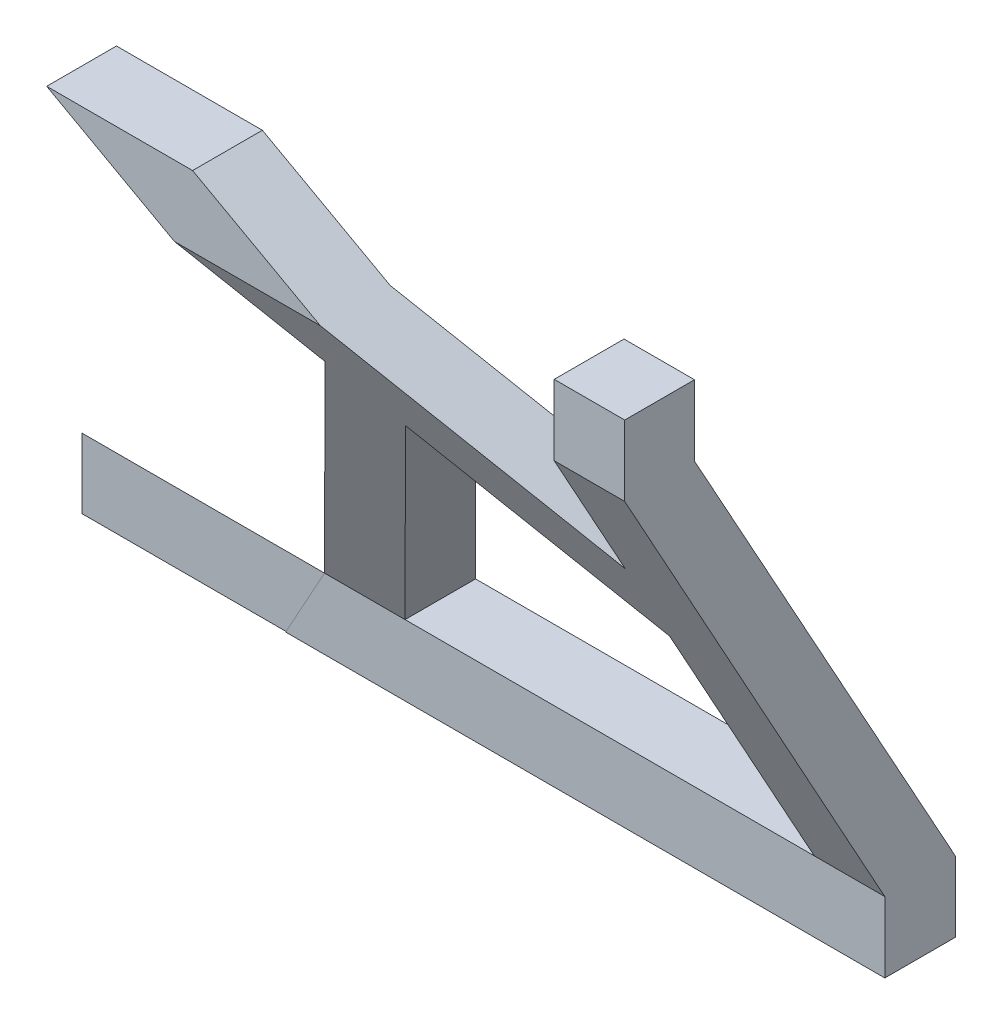
ISO-10303-21;
HEADER;
FILE_DESCRIPTION(('STEP AP214'),'2;1');
FILE_NAME('part.step','',(''),(''),'','','');
FILE_SCHEMA(('AUTOMOTIVE_DESIGN { 1 0 10303 214 1 1 1 1 }'));
ENDSEC;
DATA;
#1=APPLICATION_CONTEXT('core data for automotive mechanical design processes');
#2=APPLICATION_PROTOCOL_DEFINITION('international standard','automotive_design',2000,#1);
#3=PRODUCT_CONTEXT('',#1,'mechanical');
#4=PRODUCT('Part','Part','',(#3));
#5=PRODUCT_RELATED_PRODUCT_CATEGORY('part','',(#4));
#6=PRODUCT_DEFINITION_FORMATION('','',#4);
#7=PRODUCT_DEFINITION_CONTEXT('part definition',#1,'design');
#8=PRODUCT_DEFINITION('design','',#6,#7);
#9=PRODUCT_DEFINITION_SHAPE('','',#8);
#10=(LENGTH_UNIT() NAMED_UNIT(*) SI_UNIT(.MILLI.,.METRE.));
#11=(NAMED_UNIT(*) PLANE_ANGLE_UNIT() SI_UNIT($,.RADIAN.));
#12=(NAMED_UNIT(*) SI_UNIT($,.STERADIAN.) SOLID_ANGLE_UNIT());
#13=UNCERTAINTY_MEASURE_WITH_UNIT(LENGTH_MEASURE(1.E-05),#10,'distance_accuracy_value','');
#14=(GEOMETRIC_REPRESENTATION_CONTEXT(3) GLOBAL_UNCERTAINTY_ASSIGNED_CONTEXT((#13)) GLOBAL_UNIT_ASSIGNED_CONTEXT((#10,
#11,#12)) REPRESENTATION_CONTEXT('',''));
#15=CARTESIAN_POINT('',(0.,0.,0.));
#16=DIRECTION('',(0.,0.,1.));
#17=DIRECTION('',(1.,0.,0.));
#18=AXIS2_PLACEMENT_3D('',#15,#16,#17);
#19=CARTESIAN_POINT('',(0.,29.5620174648456,-53.6762918738388));
#20=DIRECTION('',(0.,-0.482420541255381,0.875939736154757));
#21=DIRECTION('',(0.,0.875939736154757,0.482420541255381));
#22=AXIS2_PLACEMENT_3D('',#19,#20,#21);
#23=PLANE('',#22);
#24=DIRECTION('',(0.435173799181996,0.788649248632509,0.434345630963277));
#25=VECTOR('',#24,1.);
#26=CARTESIAN_POINT('',(61.1524327788924,3.67148150275816,-67.935407948481));
#27=LINE('',#26,#25);
#28=CARTESIAN_POINT('',(64.6444863659764,10.,-64.45));
#29=VERTEX_POINT('',#28);
#30=CARTESIAN_POINT('',(93.9619940574629,63.1310259398199,-35.188285713741));
#31=VERTEX_POINT('',#30);
#32=EDGE_CURVE('E457',#29,#31,#27,.T.);
#33=ORIENTED_EDGE('',*,*,#32,.T.);
#34=DIRECTION('',(0.846111406818246,-0.466881209960924,-0.257133084291912));
#35=VECTOR('',#34,1.);
#36=CARTESIAN_POINT('',(43.9773724193006,90.7123591328342,-19.9979693731107));
#37=LINE('',#36,#35);
#38=CARTESIAN_POINT('',(122.705142441915,47.2706607589708,-43.9233226566265));
#39=VERTEX_POINT('',#38);
#40=EDGE_CURVE('E445',#31,#39,#37,.T.);
#41=ORIENTED_EDGE('',*,*,#40,.T.);
#42=DIRECTION('',(0.,-0.875939736154757,-0.482420541255381));
#43=VECTOR('',#42,1.);
#44=CARTESIAN_POINT('',(122.705142441915,29.562017464846,-53.6762918738386));
#45=LINE('',#44,#43);
#46=CARTESIAN_POINT('',(122.705142441915,10.,-64.45));
#47=VERTEX_POINT('',#46);
#48=EDGE_CURVE('E449',#39,#47,#45,.T.);
#49=ORIENTED_EDGE('',*,*,#48,.T.);
#50=DIRECTION('',(1.,0.,0.));
#51=VECTOR('',#50,1.);
#52=CARTESIAN_POINT('',(0.,10.,-64.45));
#53=LINE('',#52,#51);
#54=CARTESIAN_POINT('',(132.705142441915,10.,-64.45));
#55=VERTEX_POINT('',#54);
#56=EDGE_CURVE('E820',#55,#47,#53,.F.);
#57=ORIENTED_EDGE('',*,*,#56,.F.);
#58=DIRECTION('',(0.,-0.875939736154757,-0.482420541255381));
#59=VECTOR('',#58,1.);
#60=CARTESIAN_POINT('',(132.705142441915,77.,-27.55));
#61=LINE('',#60,#59);
#62=CARTESIAN_POINT('',(132.705142441915,77.,-27.55));
#63=VERTEX_POINT('',#62);
#64=EDGE_CURVE('E489',#63,#55,#61,.T.);
#65=ORIENTED_EDGE('',*,*,#64,.F.);
#66=DIRECTION('',(-1.,0.,0.));
#67=VECTOR('',#66,1.);
#68=CARTESIAN_POINT('',(50.7051424419148,77.,-27.55));
#69=LINE('',#68,#67);
#70=CARTESIAN_POINT('',(122.705142441915,77.,-27.55));
#71=VERTEX_POINT('',#70);
#72=EDGE_CURVE('E484',#63,#71,#69,.T.);
#73=ORIENTED_EDGE('',*,*,#72,.T.);
#74=DIRECTION('',(0.,0.875939736154757,0.482420541255381));
#75=VECTOR('',#74,1.);
#76=CARTESIAN_POINT('',(122.705142441915,29.5620174648453,-53.6762918738389));
#77=LINE('',#76,#75);
#78=CARTESIAN_POINT('',(122.705142441915,58.6920408995561,-37.6330401612893));
#79=VERTEX_POINT('',#78);
#80=EDGE_CURVE('E370',#79,#71,#77,.T.);
#81=ORIENTED_EDGE('',*,*,#80,.F.);
#82=DIRECTION('',(0.846111406818246,-0.466881209960924,-0.257133084291912));
#83=VECTOR('',#82,1.);
#84=CARTESIAN_POINT('',(49.8577346026244,98.8889767172891,-15.4947277482393));
#85=LINE('',#84,#83);
#86=CARTESIAN_POINT('',(89.5263108677249,77.,-27.55));
#87=VERTEX_POINT('',#86);
#88=EDGE_CURVE('E392',#87,#79,#85,.T.);
#89=ORIENTED_EDGE('',*,*,#88,.F.);
#90=CARTESIAN_POINT('',(68.8277695420515,77.,-27.55));
#91=VERTEX_POINT('',#90);
#92=EDGE_CURVE('E787',#87,#91,#69,.T.);
#93=ORIENTED_EDGE('',*,*,#92,.T.);
#94=DIRECTION('',(0.846111406818246,-0.466881209960925,-0.257133084291912));
#95=VECTOR('',#94,1.);
#96=CARTESIAN_POINT('',(43.9773724193007,90.7123591328342,-19.9979693731107));
#97=LINE('',#96,#95);
#98=CARTESIAN_POINT('',(85.2064847609414,67.9622842602294,-32.5274882208588));
#99=VERTEX_POINT('',#98);
#100=EDGE_CURVE('E415',#91,#99,#97,.T.);
#101=ORIENTED_EDGE('',*,*,#100,.T.);
#102=DIRECTION('',(-0.435173799181996,-0.788649248632509,-0.434345630963277));
#103=VECTOR('',#102,1.);
#104=CARTESIAN_POINT('',(51.8939906134827,7.59129333924137,-65.7765862057014));
#105=LINE('',#104,#103);
#106=CARTESIAN_POINT('',(53.2231062253911,10.,-64.45));
#107=VERTEX_POINT('',#106);
#108=EDGE_CURVE('E438',#99,#107,#105,.T.);
#109=ORIENTED_EDGE('',*,*,#108,.T.);
#110=EDGE_CURVE('E827',#29,#107,#53,.F.);
#111=ORIENTED_EDGE('',*,*,#110,.F.);
#112=EDGE_LOOP('',(#33,#41,#49,#57,#65,#73,#81,#89,#93,#101,#109,#111));
#113=FACE_BOUND('',#112,.T.);
#114=ADVANCED_FACE('F179',(#113),#23,.T.);
#115=CARTESIAN_POINT('',(0.,33.842872994196,-61.2830402867873));
#116=DIRECTION('',(0.,0.483422700834169,-0.875387052861874));
#117=DIRECTION('',(0.,-0.875387052861874,-0.483422700834169));
#118=AXIS2_PLACEMENT_3D('',#115,#116,#117);
#119=PLANE('',#118);
#120=DIRECTION('',(-0.434951180292689,-0.788245804720872,-0.435299922010034));
#121=VECTOR('',#120,1.);
#122=CARTESIAN_POINT('',(63.082326799024,7.16895646972114,-76.0134120988107));
#123=LINE('',#122,#121);
#124=CARTESIAN_POINT('',(93.9619940574629,63.1310259398199,-45.1089856750248));
#125=VERTEX_POINT('',#124);
#126=CARTESIAN_POINT('',(64.6444863659764,10.,-74.45));
#127=VERTEX_POINT('',#126);
#128=EDGE_CURVE('E847',#125,#127,#123,.T.);
#129=ORIENTED_EDGE('',*,*,#128,.T.);
#130=DIRECTION('',(1.,0.,0.));
#131=VECTOR('',#130,1.);
#132=CARTESIAN_POINT('',(0.,9.99999999999998,-74.45));
#133=LINE('',#132,#131);
#134=CARTESIAN_POINT('',(53.2231062253911,9.99999999999998,-74.45));
#135=VERTEX_POINT('',#134);
#136=EDGE_CURVE('E832',#135,#127,#133,.T.);
#137=ORIENTED_EDGE('',*,*,#136,.F.);
#138=DIRECTION('',(0.434951180292689,0.788245804720872,0.435299922010034));
#139=VECTOR('',#138,1.);
#140=CARTESIAN_POINT('',(53.8216722408234,11.0847588692494,-73.8509540572802));
#141=LINE('',#140,#139);
#142=CARTESIAN_POINT('',(85.2064847609414,67.9622842602294,-42.4409773488285));
#143=VERTEX_POINT('',#142);
#144=EDGE_CURVE('E812',#135,#143,#141,.T.);
#145=ORIENTED_EDGE('',*,*,#144,.T.);
#146=DIRECTION('',(-0.845959635986386,0.466797463365566,0.257783673798894));
#147=VECTOR('',#146,1.);
#148=CARTESIAN_POINT('',(41.811110590326,91.9076945646152,-29.2173925538692));
#149=LINE('',#148,#147);
#150=CARTESIAN_POINT('',(68.8277695420515,77.,-37.45));
#151=VERTEX_POINT('',#150);
#152=EDGE_CURVE('E427',#143,#151,#149,.T.);
#153=ORIENTED_EDGE('',*,*,#152,.T.);
#154=DIRECTION('',(1.,0.,0.));
#155=VECTOR('',#154,1.);
#156=CARTESIAN_POINT('',(50.7051424419148,77.,-37.45));
#157=LINE('',#156,#155);
#158=CARTESIAN_POINT('',(89.5263108677249,77.,-37.45));
#159=VERTEX_POINT('',#158);
#160=EDGE_CURVE('E535',#151,#159,#157,.T.);
#161=ORIENTED_EDGE('',*,*,#160,.T.);
#162=DIRECTION('',(-0.845959635986386,0.466797463365565,0.257783673798894));
#163=VECTOR('',#162,1.);
#164=CARTESIAN_POINT('',(47.6967883045674,100.081379058361,-24.7035667886665));
#165=LINE('',#164,#163);
#166=CARTESIAN_POINT('',(122.705142441915,58.6920408995561,-47.5603654733795));
#167=VERTEX_POINT('',#166);
#168=EDGE_CURVE('E404',#167,#159,#165,.T.);
#169=ORIENTED_EDGE('',*,*,#168,.F.);
#170=DIRECTION('',(0.,-0.875387052861874,-0.483422700834169));
#171=VECTOR('',#170,1.);
#172=CARTESIAN_POINT('',(122.705142441915,33.8428729941957,-61.2830402867874));
#173=LINE('',#172,#171);
#174=CARTESIAN_POINT('',(122.705142441915,77.,-37.45));
#175=VERTEX_POINT('',#174);
#176=EDGE_CURVE('E381',#175,#167,#173,.T.);
#177=ORIENTED_EDGE('',*,*,#176,.F.);
#178=CARTESIAN_POINT('',(132.705142441915,77.,-37.45));
#179=VERTEX_POINT('',#178);
#180=EDGE_CURVE('E541',#175,#179,#157,.T.);
#181=ORIENTED_EDGE('',*,*,#180,.T.);
#182=DIRECTION('',(0.,-0.875387052861874,-0.483422700834169));
#183=VECTOR('',#182,1.);
#184=CARTESIAN_POINT('',(132.705142441915,77.,-37.45));
#185=LINE('',#184,#183);
#186=CARTESIAN_POINT('',(132.705142441915,10.,-74.45));
#187=VERTEX_POINT('',#186);
#188=EDGE_CURVE('E868',#179,#187,#185,.T.);
#189=ORIENTED_EDGE('',*,*,#188,.T.);
#190=CARTESIAN_POINT('',(122.705142441915,9.99999999999999,-74.45));
#191=VERTEX_POINT('',#190);
#192=EDGE_CURVE('E828',#191,#187,#133,.T.);
#193=ORIENTED_EDGE('',*,*,#192,.F.);
#194=DIRECTION('',(0.,0.875387052861874,0.483422700834169));
#195=VECTOR('',#194,1.);
#196=CARTESIAN_POINT('',(122.705142441915,33.8428729941964,-61.283040286787));
#197=LINE('',#196,#195);
#198=CARTESIAN_POINT('',(122.705142441915,47.2706607589708,-53.8676948047474));
#199=VERTEX_POINT('',#198);
#200=EDGE_CURVE('E850',#191,#199,#197,.T.);
#201=ORIENTED_EDGE('',*,*,#200,.T.);
#202=DIRECTION('',(-0.845959635986386,0.466797463365565,0.257783673798894));
#203=VECTOR('',#202,1.);
#204=CARTESIAN_POINT('',(41.8111105903259,91.9076945646152,-29.2173925538692));
#205=LINE('',#204,#203);
#206=EDGE_CURVE('E856',#199,#125,#205,.T.);
#207=ORIENTED_EDGE('',*,*,#206,.T.);
#208=EDGE_LOOP('',(#129,#137,#145,#153,#161,#169,#177,#181,#189,#193,#201,#207));
#209=FACE_BOUND('',#208,.T.);
#210=ADVANCED_FACE('F501',(#209),#119,.T.);
#211=CARTESIAN_POINT('',(50.7051424419148,77.,-37.45));
#212=DIRECTION('',(0.,0.,-1.));
#213=DIRECTION('',(1.,0.,0.));
#214=AXIS2_PLACEMENT_3D('',#211,#212,#213);
#215=PLANE('',#214);
#216=DIRECTION('',(-0.875550929652146,0.483125832040953,0.));
#217=VECTOR('',#216,1.);
#218=CARTESIAN_POINT('',(54.9351551557391,84.6658943041474,-37.45));
#219=LINE('',#218,#217);
#220=CARTESIAN_POINT('',(50.7051424419148,87.,-37.45));
#221=VERTEX_POINT('',#220);
#222=EDGE_CURVE('E421',#151,#221,#219,.T.);
#223=ORIENTED_EDGE('',*,*,#222,.T.);
#224=DIRECTION('',(1.,0.,0.));
#225=VECTOR('',#224,1.);
#226=CARTESIAN_POINT('',(50.7051424419148,87.,-37.45));
#227=LINE('',#226,#225);
#228=CARTESIAN_POINT('',(71.4036837675881,87.,-37.45));
#229=VERTEX_POINT('',#228);
#230=EDGE_CURVE('E473',#221,#229,#227,.T.);
#231=ORIENTED_EDGE('',*,*,#230,.T.);
#232=DIRECTION('',(-0.875550929652146,0.483125832040952,0.));
#233=VECTOR('',#232,1.);
#234=CARTESIAN_POINT('',(59.7664134761486,93.4214036006688,-37.45));
#235=LINE('',#234,#233);
#236=EDGE_CURVE('E398',#159,#229,#235,.T.);
#237=ORIENTED_EDGE('',*,*,#236,.F.);
#238=ORIENTED_EDGE('',*,*,#160,.F.);
#239=EDGE_LOOP('',(#223,#231,#237,#238));
#240=FACE_BOUND('',#239,.T.);
#241=ADVANCED_FACE('F508',(#240),#215,.T.);
#242=CARTESIAN_POINT('',(122.705142441915,87.,-37.45));
#243=VERTEX_POINT('',#242);
#244=CARTESIAN_POINT('',(132.705142441915,87.,-37.45));
#245=VERTEX_POINT('',#244);
#246=EDGE_CURVE('E472',#243,#245,#227,.T.);
#247=ORIENTED_EDGE('',*,*,#246,.T.);
#248=DIRECTION('',(0.,1.,0.));
#249=VECTOR('',#248,1.);
#250=CARTESIAN_POINT('',(132.705142441915,77.,-37.45));
#251=LINE('',#250,#249);
#252=EDGE_CURVE('E771',#179,#245,#251,.T.);
#253=ORIENTED_EDGE('',*,*,#252,.F.);
#254=ORIENTED_EDGE('',*,*,#180,.F.);
#255=DIRECTION('',(0.,-1.,0.));
#256=VECTOR('',#255,1.);
#257=CARTESIAN_POINT('',(122.705142441915,76.9999999999998,-37.45));
#258=LINE('',#257,#256);
#259=EDGE_CURVE('E376',#243,#175,#258,.T.);
#260=ORIENTED_EDGE('',*,*,#259,.F.);
#261=EDGE_LOOP('',(#247,#253,#254,#260));
#262=FACE_BOUND('',#261,.T.);
#263=ADVANCED_FACE('F559',(#262),#215,.T.);
#264=CARTESIAN_POINT('',(50.7051424419148,77.,-27.55));
#265=DIRECTION('',(0.,0.,1.));
#266=DIRECTION('',(-1.,0.,0.));
#267=AXIS2_PLACEMENT_3D('',#264,#265,#266);
#268=PLANE('',#267);
#269=DIRECTION('',(0.875550929652146,-0.483125832040953,0.));
#270=VECTOR('',#269,1.);
#271=CARTESIAN_POINT('',(54.9351551557391,84.6658943041474,-27.55));
#272=LINE('',#271,#270);
#273=CARTESIAN_POINT('',(50.7051424419148,87.,-27.55));
#274=VERTEX_POINT('',#273);
#275=EDGE_CURVE('E410',#274,#91,#272,.T.);
#276=ORIENTED_EDGE('',*,*,#275,.T.);
#277=ORIENTED_EDGE('',*,*,#92,.F.);
#278=DIRECTION('',(0.875550929652146,-0.483125832040952,0.));
#279=VECTOR('',#278,1.);
#280=CARTESIAN_POINT('',(59.7664134761486,93.4214036006688,-27.55));
#281=LINE('',#280,#279);
#282=CARTESIAN_POINT('',(71.4036837675881,87.,-27.55));
#283=VERTEX_POINT('',#282);
#284=EDGE_CURVE('E387',#283,#87,#281,.T.);
#285=ORIENTED_EDGE('',*,*,#284,.F.);
#286=DIRECTION('',(-1.,0.,0.));
#287=VECTOR('',#286,1.);
#288=CARTESIAN_POINT('',(50.7051424419148,87.,-27.55));
#289=LINE('',#288,#287);
#290=EDGE_CURVE('E464',#283,#274,#289,.T.);
#291=ORIENTED_EDGE('',*,*,#290,.T.);
#292=EDGE_LOOP('',(#276,#277,#285,#291));
#293=FACE_BOUND('',#292,.T.);
#294=ADVANCED_FACE('F502',(#293),#268,.T.);
#295=ORIENTED_EDGE('',*,*,#72,.F.);
#296=DIRECTION('',(0.,1.,0.));
#297=VECTOR('',#296,1.);
#298=CARTESIAN_POINT('',(132.705142441915,77.,-27.55));
#299=LINE('',#298,#297);
#300=CARTESIAN_POINT('',(132.705142441915,87.,-27.55));
#301=VERTEX_POINT('',#300);
#302=EDGE_CURVE('E477',#63,#301,#299,.T.);
#303=ORIENTED_EDGE('',*,*,#302,.T.);
#304=CARTESIAN_POINT('',(122.705142441915,87.,-27.55));
#305=VERTEX_POINT('',#304);
#306=EDGE_CURVE('E465',#301,#305,#289,.T.);
#307=ORIENTED_EDGE('',*,*,#306,.T.);
#308=DIRECTION('',(0.,1.,0.));
#309=VECTOR('',#308,1.);
#310=CARTESIAN_POINT('',(122.705142441915,76.9999999999998,-27.55));
#311=LINE('',#310,#309);
#312=EDGE_CURVE('E366',#71,#305,#311,.T.);
#313=ORIENTED_EDGE('',*,*,#312,.F.);
#314=EDGE_LOOP('',(#295,#303,#307,#313));
#315=FACE_BOUND('',#314,.T.);
#316=ADVANCED_FACE('F565',(#315),#268,.T.);
#317=CARTESIAN_POINT('',(0.,87.,0.));
#318=DIRECTION('',(0.,-1.,0.));
#319=DIRECTION('',(0.,0.,1.));
#320=AXIS2_PLACEMENT_3D('',#317,#318,#319);
#321=PLANE('',#320);
#322=DIRECTION('',(0.,0.,-1.));
#323=VECTOR('',#322,1.);
#324=CARTESIAN_POINT('',(71.4036837675881,87.,0.));
#325=LINE('',#324,#323);
#326=EDGE_CURVE('E792',#283,#229,#325,.T.);
#327=ORIENTED_EDGE('',*,*,#326,.T.);
#328=ORIENTED_EDGE('',*,*,#230,.F.);
#329=DIRECTION('',(0.,0.,-1.));
#330=VECTOR('',#329,1.);
#331=CARTESIAN_POINT('',(50.7051424419148,87.,-37.45));
#332=LINE('',#331,#330);
#333=EDGE_CURVE('E469',#274,#221,#332,.T.);
#334=ORIENTED_EDGE('',*,*,#333,.F.);
#335=ORIENTED_EDGE('',*,*,#290,.F.);
#336=EDGE_LOOP('',(#327,#328,#334,#335));
#337=FACE_BOUND('',#336,.T.);
#338=ADVANCED_FACE('F561',(#337),#321,.F.);
#339=DIRECTION('',(0.,0.,1.));
#340=VECTOR('',#339,1.);
#341=CARTESIAN_POINT('',(122.705142441915,87.,0.));
#342=LINE('',#341,#340);
#343=EDGE_CURVE('E806',#243,#305,#342,.T.);
#344=ORIENTED_EDGE('',*,*,#343,.T.);
#345=ORIENTED_EDGE('',*,*,#306,.F.);
#346=DIRECTION('',(0.,0.,1.));
#347=VECTOR('',#346,1.);
#348=CARTESIAN_POINT('',(132.705142441915,87.,-37.45));
#349=LINE('',#348,#347);
#350=EDGE_CURVE('E461',#245,#301,#349,.T.);
#351=ORIENTED_EDGE('',*,*,#350,.F.);
#352=ORIENTED_EDGE('',*,*,#246,.F.);
#353=EDGE_LOOP('',(#344,#345,#351,#352));
#354=FACE_BOUND('',#353,.T.);
#355=ADVANCED_FACE('F564',(#354),#321,.F.);
#356=CARTESIAN_POINT('',(47.7051424419148,10.,-74.45));
#357=DIRECTION('',(0.,0.,1.));
#358=DIRECTION('',(-1.,0.,0.));
#359=AXIS2_PLACEMENT_3D('',#356,#357,#358);
#360=PLANE('',#359);
#361=ORIENTED_EDGE('',*,*,#136,.T.);
#362=EDGE_CURVE('E830',#127,#191,#133,.T.);
#363=ORIENTED_EDGE('',*,*,#362,.T.);
#364=ORIENTED_EDGE('',*,*,#192,.T.);
#365=DIRECTION('',(0.,-1.,0.));
#366=VECTOR('',#365,1.);
#367=CARTESIAN_POINT('',(132.705142441915,10.,-74.45));
#368=LINE('',#367,#366);
#369=CARTESIAN_POINT('',(132.705142441915,0.,-74.45));
#370=VERTEX_POINT('',#369);
#371=EDGE_CURVE('E808',#187,#370,#368,.T.);
#372=ORIENTED_EDGE('',*,*,#371,.T.);
#373=DIRECTION('',(1.,0.,0.));
#374=VECTOR('',#373,1.);
#375=CARTESIAN_POINT('',(47.7051424419148,0.,-74.45));
#376=LINE('',#375,#374);
#377=CARTESIAN_POINT('',(47.7051424419148,0.,-74.45));
#378=VERTEX_POINT('',#377);
#379=EDGE_CURVE('E872',#378,#370,#376,.T.);
#380=ORIENTED_EDGE('',*,*,#379,.F.);
#381=DIRECTION('',(-0.483125832040953,-0.875550929652146,0.));
#382=VECTOR('',#381,1.);
#383=CARTESIAN_POINT('',(51.9351551557391,7.66589430414738,-74.45));
#384=LINE('',#383,#382);
#385=EDGE_CURVE('E433',#135,#378,#384,.T.);
#386=ORIENTED_EDGE('',*,*,#385,.F.);
#387=EDGE_LOOP('',(#361,#363,#364,#372,#380,#386));
#388=FACE_BOUND('',#387,.T.);
#389=ADVANCED_FACE('F181',(#388),#360,.F.);
#390=CARTESIAN_POINT('',(132.705142441915,10.,-74.45));
#391=DIRECTION('',(-1.,0.,0.));
#392=DIRECTION('',(0.,0.,-1.));
#393=AXIS2_PLACEMENT_3D('',#390,#391,#392);
#394=PLANE('',#393);
#395=ORIENTED_EDGE('',*,*,#371,.F.);
#396=ORIENTED_EDGE('',*,*,#188,.F.);
#397=ORIENTED_EDGE('',*,*,#252,.T.);
#398=ORIENTED_EDGE('',*,*,#350,.T.);
#399=ORIENTED_EDGE('',*,*,#302,.F.);
#400=ORIENTED_EDGE('',*,*,#64,.T.);
#401=DIRECTION('',(0.,-1.,0.));
#402=VECTOR('',#401,1.);
#403=CARTESIAN_POINT('',(132.705142441915,10.,-64.45));
#404=LINE('',#403,#402);
#405=CARTESIAN_POINT('',(132.705142441915,0.,-64.45));
#406=VERTEX_POINT('',#405);
#407=EDGE_CURVE('E814',#55,#406,#404,.T.);
#408=ORIENTED_EDGE('',*,*,#407,.T.);
#409=DIRECTION('',(0.,0.,1.));
#410=VECTOR('',#409,1.);
#411=CARTESIAN_POINT('',(132.705142441915,0.,-74.45));
#412=LINE('',#411,#410);
#413=EDGE_CURVE('E875',#370,#406,#412,.T.);
#414=ORIENTED_EDGE('',*,*,#413,.F.);
#415=EDGE_LOOP('',(#395,#396,#397,#398,#399,#400,#408,#414));
#416=FACE_BOUND('',#415,.T.);
#417=ADVANCED_FACE('F659',(#416),#394,.F.);
#418=CARTESIAN_POINT('',(47.7051424419148,10.,-64.45));
#419=DIRECTION('',(0.,0.,-1.));
#420=DIRECTION('',(1.,0.,0.));
#421=AXIS2_PLACEMENT_3D('',#418,#419,#420);
#422=PLANE('',#421);
#423=DIRECTION('',(-1.,0.,0.));
#424=VECTOR('',#423,1.);
#425=CARTESIAN_POINT('',(47.7051424419148,0.,-64.45));
#426=LINE('',#425,#424);
#427=CARTESIAN_POINT('',(47.7051424419148,0.,-64.45));
#428=VERTEX_POINT('',#427);
#429=EDGE_CURVE('E831',#406,#428,#426,.T.);
#430=ORIENTED_EDGE('',*,*,#429,.F.);
#431=ORIENTED_EDGE('',*,*,#407,.F.);
#432=ORIENTED_EDGE('',*,*,#56,.T.);
#433=DIRECTION('',(-1.,0.,0.));
#434=VECTOR('',#433,1.);
#435=CARTESIAN_POINT('',(0.,10.,-64.45));
#436=LINE('',#435,#434);
#437=EDGE_CURVE('E453',#47,#29,#436,.T.);
#438=ORIENTED_EDGE('',*,*,#437,.T.);
#439=ORIENTED_EDGE('',*,*,#110,.T.);
#440=DIRECTION('',(0.483125832040953,0.875550929652146,0.));
#441=VECTOR('',#440,1.);
#442=CARTESIAN_POINT('',(51.9351551557391,7.66589430414738,-64.45));
#443=LINE('',#442,#441);
#444=EDGE_CURVE('E442',#428,#107,#443,.T.);
#445=ORIENTED_EDGE('',*,*,#444,.F.);
#446=EDGE_LOOP('',(#430,#431,#432,#438,#439,#445));
#447=FACE_BOUND('',#446,.T.);
#448=ADVANCED_FACE('F653',(#447),#422,.F.);
#449=CARTESIAN_POINT('',(0.,0.,0.));
#450=DIRECTION('',(0.,-1.,0.));
#451=DIRECTION('',(0.,0.,1.));
#452=AXIS2_PLACEMENT_3D('',#449,#450,#451);
#453=PLANE('',#452);
#454=ORIENTED_EDGE('',*,*,#429,.T.);
#455=DIRECTION('',(0.,0.,-1.));
#456=VECTOR('',#455,1.);
#457=CARTESIAN_POINT('',(47.7051424419148,0.,-74.45));
#458=LINE('',#457,#456);
#459=CARTESIAN_POINT('',(47.7051424419148,0.,-64.55));
#460=VERTEX_POINT('',#459);
#461=EDGE_CURVE('E843',#428,#460,#458,.T.);
#462=ORIENTED_EDGE('',*,*,#461,.T.);
#463=DIRECTION('',(1.,0.,0.));
#464=VECTOR('',#463,1.);
#465=CARTESIAN_POINT('',(18.7051424419149,0.,-64.55));
#466=LINE('',#465,#464);
#467=CARTESIAN_POINT('',(18.7051424419149,0.,-64.55));
#468=VERTEX_POINT('',#467);
#469=EDGE_CURVE('E334',#468,#460,#466,.T.);
#470=ORIENTED_EDGE('',*,*,#469,.F.);
#471=DIRECTION('',(0.,0.,1.));
#472=VECTOR('',#471,1.);
#473=CARTESIAN_POINT('',(18.7051424419149,0.,-64.55));
#474=LINE('',#473,#472);
#475=CARTESIAN_POINT('',(18.7051424419149,0.,-74.45));
#476=VERTEX_POINT('',#475);
#477=EDGE_CURVE('E322',#476,#468,#474,.T.);
#478=ORIENTED_EDGE('',*,*,#477,.F.);
#479=DIRECTION('',(1.,0.,0.));
#480=VECTOR('',#479,1.);
#481=CARTESIAN_POINT('',(18.7051424419149,0.,-74.45));
#482=LINE('',#481,#480);
#483=EDGE_CURVE('E328',#476,#378,#482,.T.);
#484=ORIENTED_EDGE('',*,*,#483,.T.);
#485=ORIENTED_EDGE('',*,*,#379,.T.);
#486=ORIENTED_EDGE('',*,*,#413,.T.);
#487=EDGE_LOOP('',(#454,#462,#470,#478,#484,#485,#486));
#488=FACE_BOUND('',#487,.T.);
#489=ADVANCED_FACE('F337',(#488),#453,.T.);
#490=CARTESIAN_POINT('',(53.4674851089494,96.8971294611604,-27.5499));
#491=DIRECTION('',(0.483125832040952,0.875550929652146,0.));
#492=DIRECTION('',(-0.875550929652146,0.483125832040952,0.));
#493=AXIS2_PLACEMENT_3D('',#490,#491,#492);
#494=PLANE('',#493);
#495=DIRECTION('',(0.,0.,1.));
#496=VECTOR('',#495,1.);
#497=CARTESIAN_POINT('',(122.705142441915,58.6920408995561,-27.5499));
#498=LINE('',#497,#496);
#499=EDGE_CURVE('E363',#167,#79,#498,.T.);
#500=ORIENTED_EDGE('',*,*,#499,.F.);
#501=ORIENTED_EDGE('',*,*,#168,.T.);
#502=ORIENTED_EDGE('',*,*,#236,.T.);
#503=ORIENTED_EDGE('',*,*,#326,.F.);
#504=ORIENTED_EDGE('',*,*,#284,.T.);
#505=ORIENTED_EDGE('',*,*,#88,.T.);
#506=EDGE_LOOP('',(#500,#501,#502,#503,#504,#505));
#507=FACE_BOUND('',#506,.T.);
#508=ADVANCED_FACE('F567',(#507),#494,.T.);
#509=CARTESIAN_POINT('',(122.705142441915,-3.00776881105116E-13,-27.5499));
#510=DIRECTION('',(-1.,0.,0.));
#511=DIRECTION('',(0.,-1.,0.));
#512=AXIS2_PLACEMENT_3D('',#509,#510,#511);
#513=PLANE('',#512);
#514=ORIENTED_EDGE('',*,*,#259,.T.);
#515=ORIENTED_EDGE('',*,*,#176,.T.);
#516=ORIENTED_EDGE('',*,*,#499,.T.);
#517=ORIENTED_EDGE('',*,*,#80,.T.);
#518=ORIENTED_EDGE('',*,*,#312,.T.);
#519=ORIENTED_EDGE('',*,*,#343,.F.);
#520=EDGE_LOOP('',(#514,#515,#516,#517,#518,#519));
#521=FACE_BOUND('',#520,.T.);
#522=ADVANCED_FACE('F570',(#521),#513,.T.);
#523=CARTESIAN_POINT('',(85.2064847609414,67.9622842602294,-27.5499));
#524=DIRECTION('',(0.875550929652146,-0.483125832040953,0.));
#525=DIRECTION('',(0.483125832040953,0.875550929652146,0.));
#526=AXIS2_PLACEMENT_3D('',#523,#524,#525);
#527=PLANE('',#526);
#528=DIRECTION('',(0.483125832040953,0.875550929652146,0.));
#529=VECTOR('',#528,1.);
#530=CARTESIAN_POINT('',(85.2064847609414,67.9622842602294,-64.55));
#531=LINE('',#530,#529);
#532=CARTESIAN_POINT('',(53.1679265875563,9.9,-64.55));
#533=VERTEX_POINT('',#532);
#534=EDGE_CURVE('E188',#460,#533,#531,.T.);
#535=ORIENTED_EDGE('',*,*,#534,.F.);
#536=ORIENTED_EDGE('',*,*,#461,.F.);
#537=ORIENTED_EDGE('',*,*,#444,.T.);
#538=ORIENTED_EDGE('',*,*,#108,.F.);
#539=DIRECTION('',(0.,0.,1.));
#540=VECTOR('',#539,1.);
#541=CARTESIAN_POINT('',(85.2064847609414,67.9622842602294,-27.5499));
#542=LINE('',#541,#540);
#543=EDGE_CURVE('E346',#143,#99,#542,.T.);
#544=ORIENTED_EDGE('',*,*,#543,.F.);
#545=ORIENTED_EDGE('',*,*,#144,.F.);
#546=ORIENTED_EDGE('',*,*,#385,.T.);
#547=DIRECTION('',(-0.363489981504622,-0.658739338944384,-0.658739338944385));
#548=VECTOR('',#547,1.);
#549=CARTESIAN_POINT('',(80.1632468887006,58.8226123266387,-15.6273876733613));
#550=LINE('',#549,#548);
#551=EDGE_CURVE('E12',#533,#378,#550,.T.);
#552=ORIENTED_EDGE('',*,*,#551,.F.);
#553=EDGE_LOOP('',(#535,#536,#537,#538,#544,#545,#546,#552));
#554=FACE_BOUND('',#553,.T.);
#555=ADVANCED_FACE('F574',(#554),#527,.F.);
#556=CARTESIAN_POINT('',(50.7051424419148,87.,-27.5499));
#557=DIRECTION('',(0.483125832040953,0.875550929652146,0.));
#558=DIRECTION('',(-0.875550929652146,0.483125832040953,0.));
#559=AXIS2_PLACEMENT_3D('',#556,#557,#558);
#560=PLANE('',#559);
#561=ORIENTED_EDGE('',*,*,#152,.F.);
#562=ORIENTED_EDGE('',*,*,#543,.T.);
#563=ORIENTED_EDGE('',*,*,#100,.F.);
#564=ORIENTED_EDGE('',*,*,#275,.F.);
#565=ORIENTED_EDGE('',*,*,#333,.T.);
#566=ORIENTED_EDGE('',*,*,#222,.F.);
#567=EDGE_LOOP('',(#561,#562,#563,#564,#565,#566));
#568=FACE_BOUND('',#567,.T.);
#569=ADVANCED_FACE('F591',(#568),#560,.F.);
#570=CARTESIAN_POINT('',(45.3257672689229,-25.0105942248191,-27.5499));
#571=DIRECTION('',(-0.875550929652146,0.483125832040953,0.));
#572=DIRECTION('',(-0.483125832040953,-0.875550929652146,0.));
#573=AXIS2_PLACEMENT_3D('',#570,#571,#572);
#574=PLANE('',#573);
#575=ORIENTED_EDGE('',*,*,#32,.F.);
#576=DIRECTION('',(0.,0.,1.));
#577=VECTOR('',#576,1.);
#578=CARTESIAN_POINT('',(64.6444863659764,10.,-27.5499));
#579=LINE('',#578,#577);
#580=EDGE_CURVE('E351',#127,#29,#579,.T.);
#581=ORIENTED_EDGE('',*,*,#580,.F.);
#582=ORIENTED_EDGE('',*,*,#128,.F.);
#583=DIRECTION('',(0.,0.,1.));
#584=VECTOR('',#583,1.);
#585=CARTESIAN_POINT('',(93.9619940574629,63.1310259398199,-27.5499));
#586=LINE('',#585,#584);
#587=EDGE_CURVE('E360',#125,#31,#586,.T.);
#588=ORIENTED_EDGE('',*,*,#587,.T.);
#589=EDGE_LOOP('',(#575,#581,#582,#588));
#590=FACE_BOUND('',#589,.T.);
#591=ADVANCED_FACE('F587',(#590),#574,.F.);
#592=CARTESIAN_POINT('',(0.,10.,-27.5499));
#593=DIRECTION('',(0.,-1.,0.));
#594=DIRECTION('',(1.,0.,0.));
#595=AXIS2_PLACEMENT_3D('',#592,#593,#594);
#596=PLANE('',#595);
#597=ORIENTED_EDGE('',*,*,#437,.F.);
#598=DIRECTION('',(0.,0.,1.));
#599=VECTOR('',#598,1.);
#600=CARTESIAN_POINT('',(122.705142441915,9.99999999999999,-27.5499));
#601=LINE('',#600,#599);
#602=EDGE_CURVE('E354',#191,#47,#601,.T.);
#603=ORIENTED_EDGE('',*,*,#602,.F.);
#604=ORIENTED_EDGE('',*,*,#362,.F.);
#605=ORIENTED_EDGE('',*,*,#580,.T.);
#606=EDGE_LOOP('',(#597,#603,#604,#605));
#607=FACE_BOUND('',#606,.T.);
#608=ADVANCED_FACE('F583',(#607),#596,.F.);
#609=CARTESIAN_POINT('',(122.705142441915,5.93962828556688E-13,-27.5499));
#610=DIRECTION('',(1.,0.,0.));
#611=DIRECTION('',(0.,1.,0.));
#612=AXIS2_PLACEMENT_3D('',#609,#610,#611);
#613=PLANE('',#612);
#614=ORIENTED_EDGE('',*,*,#48,.F.);
#615=DIRECTION('',(0.,0.,1.));
#616=VECTOR('',#615,1.);
#617=CARTESIAN_POINT('',(122.705142441915,47.2706607589708,-27.5499));
#618=LINE('',#617,#616);
#619=EDGE_CURVE('E357',#199,#39,#618,.T.);
#620=ORIENTED_EDGE('',*,*,#619,.F.);
#621=ORIENTED_EDGE('',*,*,#200,.F.);
#622=ORIENTED_EDGE('',*,*,#602,.T.);
#623=EDGE_LOOP('',(#614,#620,#621,#622));
#624=FACE_BOUND('',#623,.T.);
#625=ADVANCED_FACE('F579',(#624),#613,.F.);
#626=CARTESIAN_POINT('',(48.63622678854,88.141620164639,-27.5499));
#627=DIRECTION('',(0.483125832040953,0.875550929652146,0.));
#628=DIRECTION('',(-0.875550929652146,0.483125832040953,0.));
#629=AXIS2_PLACEMENT_3D('',#626,#627,#628);
#630=PLANE('',#629);
#631=ORIENTED_EDGE('',*,*,#40,.F.);
#632=ORIENTED_EDGE('',*,*,#587,.F.);
#633=ORIENTED_EDGE('',*,*,#206,.F.);
#634=ORIENTED_EDGE('',*,*,#619,.T.);
#635=EDGE_LOOP('',(#631,#632,#633,#634));
#636=FACE_BOUND('',#635,.T.);
#637=ADVANCED_FACE('F576',(#636),#630,.F.);
#638=CARTESIAN_POINT('',(18.7051424419149,0.,-74.45));
#639=DIRECTION('',(0.,0.707106781186548,-0.707106781186547));
#640=DIRECTION('',(0.,-0.707106781186547,-0.707106781186548));
#641=AXIS2_PLACEMENT_3D('',#638,#639,#640);
#642=PLANE('',#641);
#643=ORIENTED_EDGE('',*,*,#551,.T.);
#644=ORIENTED_EDGE('',*,*,#483,.F.);
#645=DIRECTION('',(0.,-0.707106781186547,-0.707106781186548));
#646=VECTOR('',#645,1.);
#647=CARTESIAN_POINT('',(18.7051424419149,0.,-74.45));
#648=LINE('',#647,#646);
#649=CARTESIAN_POINT('',(18.7051424419149,9.9,-64.55));
#650=VERTEX_POINT('',#649);
#651=EDGE_CURVE('E318',#650,#476,#648,.T.);
#652=ORIENTED_EDGE('',*,*,#651,.F.);
#653=DIRECTION('',(1.,0.,0.));
#654=VECTOR('',#653,1.);
#655=CARTESIAN_POINT('',(18.7051424419149,9.9,-64.55));
#656=LINE('',#655,#654);
#657=EDGE_CURVE('E194',#650,#533,#656,.T.);
#658=ORIENTED_EDGE('',*,*,#657,.T.);
#659=EDGE_LOOP('',(#643,#644,#652,#658));
#660=FACE_BOUND('',#659,.T.);
#661=ADVANCED_FACE('F329',(#660),#642,.T.);
#662=CARTESIAN_POINT('',(18.7051424419149,9.9,-64.55));
#663=DIRECTION('',(0.,0.,1.));
#664=DIRECTION('',(-1.,0.,0.));
#665=AXIS2_PLACEMENT_3D('',#662,#663,#664);
#666=PLANE('',#665);
#667=ORIENTED_EDGE('',*,*,#534,.T.);
#668=ORIENTED_EDGE('',*,*,#657,.F.);
#669=DIRECTION('',(0.,1.,0.));
#670=VECTOR('',#669,1.);
#671=CARTESIAN_POINT('',(18.7051424419149,9.9,-64.55));
#672=LINE('',#671,#670);
#673=EDGE_CURVE('E324',#468,#650,#672,.T.);
#674=ORIENTED_EDGE('',*,*,#673,.F.);
#675=ORIENTED_EDGE('',*,*,#469,.T.);
#676=EDGE_LOOP('',(#667,#668,#674,#675));
#677=FACE_BOUND('',#676,.T.);
#678=ADVANCED_FACE('F600',(#677),#666,.T.);
#679=CARTESIAN_POINT('',(18.7051424419149,0.,0.));
#680=DIRECTION('',(-1.,0.,0.));
#681=DIRECTION('',(0.,0.,-1.));
#682=AXIS2_PLACEMENT_3D('',#679,#680,#681);
#683=PLANE('',#682);
#684=ORIENTED_EDGE('',*,*,#651,.T.);
#685=ORIENTED_EDGE('',*,*,#477,.T.);
#686=ORIENTED_EDGE('',*,*,#673,.T.);
#687=EDGE_LOOP('',(#684,#685,#686));
#688=FACE_BOUND('',#687,.T.);
#689=ADVANCED_FACE('F320',(#688),#683,.T.);
#690=CLOSED_SHELL('',(#114,#210,#241,#263,#294,#316,#338,#355,#389,#417,#448,#489,#508,#522,
#555,#569,#591,#608,#625,#637,#661,#678,#689));
#691=MANIFOLD_SOLID_BREP('B2',#690);
#692=ADVANCED_BREP_SHAPE_REPRESENTATION('',(#18,#691),#14);
#693=SHAPE_DEFINITION_REPRESENTATION(#9,#692);
ENDSEC;
END-ISO-10303-21;
